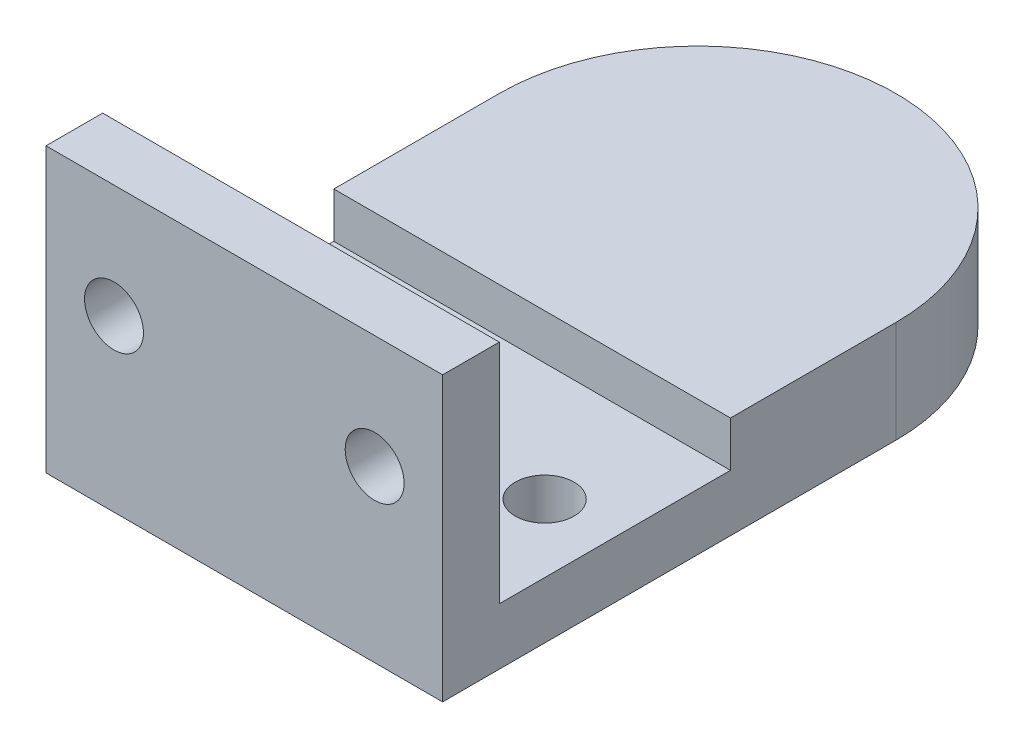
ISO-10303-21;
HEADER;
FILE_DESCRIPTION(('STEP AP214'),'2;1');
FILE_NAME('part.step','',(''),(''),'','','');
FILE_SCHEMA(('AUTOMOTIVE_DESIGN { 1 0 10303 214 1 1 1 1 }'));
ENDSEC;
DATA;
#1=APPLICATION_CONTEXT('core data for automotive mechanical design processes');
#2=APPLICATION_PROTOCOL_DEFINITION('international standard','automotive_design',2000,#1);
#3=PRODUCT_CONTEXT('',#1,'mechanical');
#4=PRODUCT('Part','Part','',(#3));
#5=PRODUCT_RELATED_PRODUCT_CATEGORY('part','',(#4));
#6=PRODUCT_DEFINITION_FORMATION('','',#4);
#7=PRODUCT_DEFINITION_CONTEXT('part definition',#1,'design');
#8=PRODUCT_DEFINITION('design','',#6,#7);
#9=PRODUCT_DEFINITION_SHAPE('','',#8);
#10=(LENGTH_UNIT() NAMED_UNIT(*) SI_UNIT(.MILLI.,.METRE.));
#11=(NAMED_UNIT(*) PLANE_ANGLE_UNIT() SI_UNIT($,.RADIAN.));
#12=(NAMED_UNIT(*) SI_UNIT($,.STERADIAN.) SOLID_ANGLE_UNIT());
#13=UNCERTAINTY_MEASURE_WITH_UNIT(LENGTH_MEASURE(1.E-05),#10,'distance_accuracy_value','');
#14=(GEOMETRIC_REPRESENTATION_CONTEXT(3) GLOBAL_UNCERTAINTY_ASSIGNED_CONTEXT((#13)) GLOBAL_UNIT_ASSIGNED_CONTEXT((#10,
#11,#12)) REPRESENTATION_CONTEXT('',''));
#15=CARTESIAN_POINT('',(0.,0.,0.));
#16=DIRECTION('',(0.,0.,1.));
#17=DIRECTION('',(1.,0.,0.));
#18=AXIS2_PLACEMENT_3D('',#15,#16,#17);
#19=CARTESIAN_POINT('',(0.,0.,0.));
#20=DIRECTION('',(0.,1.,0.));
#21=DIRECTION('',(0.,0.,1.));
#22=AXIS2_PLACEMENT_3D('',#19,#20,#21);
#23=PLANE('',#22);
#24=CARTESIAN_POINT('',(11.5,0.,25.));
#25=DIRECTION('',(0.,1.,0.));
#26=DIRECTION('',(0.,0.,1.));
#27=AXIS2_PLACEMENT_3D('',#24,#25,#26);
#28=CIRCLE('',#27,2.6);
#29=CARTESIAN_POINT('',(11.5,0.,27.6));
#30=VERTEX_POINT('',#29);
#31=EDGE_CURVE('E131',#30,#30,#28,.T.);
#32=ORIENTED_EDGE('',*,*,#31,.T.);
#33=EDGE_LOOP('',(#32));
#34=FACE_BOUND('',#33,.T.);
#35=CARTESIAN_POINT('',(-11.5,0.,25.));
#36=DIRECTION('',(0.,1.,0.));
#37=DIRECTION('',(0.,0.,1.));
#38=AXIS2_PLACEMENT_3D('',#35,#36,#37);
#39=CIRCLE('',#38,2.6);
#40=CARTESIAN_POINT('',(-11.5,0.,27.6));
#41=VERTEX_POINT('',#40);
#42=EDGE_CURVE('E135',#41,#41,#39,.T.);
#43=ORIENTED_EDGE('',*,*,#42,.T.);
#44=EDGE_LOOP('',(#43));
#45=FACE_BOUND('',#44,.T.);
#46=CARTESIAN_POINT('',(0.,0.,0.));
#47=DIRECTION('',(0.,1.,0.));
#48=DIRECTION('',(0.,0.,1.));
#49=AXIS2_PLACEMENT_3D('',#46,#47,#48);
#50=CIRCLE('',#49,17.5);
#51=CARTESIAN_POINT('',(17.5,0.,0.));
#52=VERTEX_POINT('',#51);
#53=CARTESIAN_POINT('',(-17.5,0.,0.));
#54=VERTEX_POINT('',#53);
#55=EDGE_CURVE('E148',#52,#54,#50,.T.);
#56=ORIENTED_EDGE('',*,*,#55,.F.);
#57=DIRECTION('',(0.,0.,-1.));
#58=VECTOR('',#57,1.);
#59=CARTESIAN_POINT('',(17.5,0.,0.));
#60=LINE('',#59,#58);
#61=CARTESIAN_POINT('',(17.5,0.,40.));
#62=VERTEX_POINT('',#61);
#63=EDGE_CURVE('E57',#62,#52,#60,.T.);
#64=ORIENTED_EDGE('',*,*,#63,.F.);
#65=DIRECTION('',(-1.,0.,0.));
#66=VECTOR('',#65,1.);
#67=CARTESIAN_POINT('',(-17.5,0.,40.));
#68=LINE('',#67,#66);
#69=CARTESIAN_POINT('',(-17.5,0.,40.));
#70=VERTEX_POINT('',#69);
#71=EDGE_CURVE('E160',#62,#70,#68,.T.);
#72=ORIENTED_EDGE('',*,*,#71,.T.);
#73=DIRECTION('',(0.,0.,1.));
#74=VECTOR('',#73,1.);
#75=CARTESIAN_POINT('',(-17.5,0.,0.));
#76=LINE('',#75,#74);
#77=EDGE_CURVE('E151',#54,#70,#76,.T.);
#78=ORIENTED_EDGE('',*,*,#77,.F.);
#79=EDGE_LOOP('',(#56,#64,#72,#78));
#80=FACE_BOUND('',#79,.T.);
#81=CARTESIAN_POINT('',(0.,0.,0.));
#82=DIRECTION('',(0.,1.,0.));
#83=DIRECTION('',(0.,0.,1.));
#84=AXIS2_PLACEMENT_3D('',#81,#82,#83);
#85=CIRCLE('',#84,11.1);
#86=CARTESIAN_POINT('',(0.,0.,11.1));
#87=VERTEX_POINT('',#86);
#88=EDGE_CURVE('E145',#87,#87,#85,.T.);
#89=ORIENTED_EDGE('',*,*,#88,.T.);
#90=EDGE_LOOP('',(#89));
#91=FACE_BOUND('',#90,.T.);
#92=ADVANCED_FACE('F32',(#34,#45,#80,#91),#23,.F.);
#93=CARTESIAN_POINT('',(0.,7.,0.));
#94=DIRECTION('',(0.,-1.,0.));
#95=DIRECTION('',(0.,0.,-1.));
#96=AXIS2_PLACEMENT_3D('',#93,#94,#95);
#97=CYLINDRICAL_SURFACE('',#96,17.5);
#98=ORIENTED_EDGE('',*,*,#55,.T.);
#99=DIRECTION('',(0.,-1.,0.));
#100=VECTOR('',#99,1.);
#101=CARTESIAN_POINT('',(-17.5,7.,0.));
#102=LINE('',#101,#100);
#103=CARTESIAN_POINT('',(-17.5,9.,0.));
#104=VERTEX_POINT('',#103);
#105=EDGE_CURVE('E11',#104,#54,#102,.T.);
#106=ORIENTED_EDGE('',*,*,#105,.F.);
#107=CARTESIAN_POINT('',(0.,9.,0.));
#108=DIRECTION('',(0.,1.,0.));
#109=DIRECTION('',(0.,0.,1.));
#110=AXIS2_PLACEMENT_3D('',#107,#108,#109);
#111=CIRCLE('',#110,17.5);
#112=CARTESIAN_POINT('',(17.5,9.,0.));
#113=VERTEX_POINT('',#112);
#114=EDGE_CURVE('E120',#113,#104,#111,.T.);
#115=ORIENTED_EDGE('',*,*,#114,.F.);
#116=DIRECTION('',(0.,-1.,0.));
#117=VECTOR('',#116,1.);
#118=CARTESIAN_POINT('',(17.5,7.,0.));
#119=LINE('',#118,#117);
#120=EDGE_CURVE('E41',#113,#52,#119,.T.);
#121=ORIENTED_EDGE('',*,*,#120,.T.);
#122=EDGE_LOOP('',(#98,#106,#115,#121));
#123=FACE_BOUND('',#122,.T.);
#124=ADVANCED_FACE('F34',(#123),#97,.T.);
#125=CARTESIAN_POINT('',(-17.5,7.,0.));
#126=DIRECTION('',(1.,0.,0.));
#127=DIRECTION('',(0.,0.,-1.));
#128=AXIS2_PLACEMENT_3D('',#125,#126,#127);
#129=PLANE('',#128);
#130=DIRECTION('',(0.,0.,1.));
#131=VECTOR('',#130,1.);
#132=CARTESIAN_POINT('',(-17.5,5.,15.));
#133=LINE('',#132,#131);
#134=CARTESIAN_POINT('',(-17.5,5.,14.6));
#135=VERTEX_POINT('',#134);
#136=CARTESIAN_POINT('',(-17.5,5.,35.));
#137=VERTEX_POINT('',#136);
#138=EDGE_CURVE('E114',#135,#137,#133,.T.);
#139=ORIENTED_EDGE('',*,*,#138,.F.);
#140=DIRECTION('',(0.,1.,0.));
#141=VECTOR('',#140,1.);
#142=CARTESIAN_POINT('',(-17.5,-30.002285639655,14.6));
#143=LINE('',#142,#141);
#144=CARTESIAN_POINT('',(-17.5,9.,14.6));
#145=VERTEX_POINT('',#144);
#146=EDGE_CURVE('E102',#135,#145,#143,.T.);
#147=ORIENTED_EDGE('',*,*,#146,.T.);
#148=DIRECTION('',(0.,0.,1.));
#149=VECTOR('',#148,1.);
#150=CARTESIAN_POINT('',(-17.5,9.,0.));
#151=LINE('',#150,#149);
#152=EDGE_CURVE('E110',#104,#145,#151,.T.);
#153=ORIENTED_EDGE('',*,*,#152,.F.);
#154=ORIENTED_EDGE('',*,*,#105,.T.);
#155=ORIENTED_EDGE('',*,*,#77,.T.);
#156=DIRECTION('',(0.,-1.,0.));
#157=VECTOR('',#156,1.);
#158=CARTESIAN_POINT('',(-17.5,25.,40.));
#159=LINE('',#158,#157);
#160=CARTESIAN_POINT('',(-17.5,25.,40.));
#161=VERTEX_POINT('',#160);
#162=EDGE_CURVE('E125',#161,#70,#159,.T.);
#163=ORIENTED_EDGE('',*,*,#162,.F.);
#164=DIRECTION('',(0.,0.,-1.));
#165=VECTOR('',#164,1.);
#166=CARTESIAN_POINT('',(-17.5,25.,35.));
#167=LINE('',#166,#165);
#168=CARTESIAN_POINT('',(-17.5,25.,35.));
#169=VERTEX_POINT('',#168);
#170=EDGE_CURVE('E165',#161,#169,#167,.T.);
#171=ORIENTED_EDGE('',*,*,#170,.T.);
#172=DIRECTION('',(0.,-1.,0.));
#173=VECTOR('',#172,1.);
#174=CARTESIAN_POINT('',(-17.5,25.,35.));
#175=LINE('',#174,#173);
#176=EDGE_CURVE('E186',#169,#137,#175,.T.);
#177=ORIENTED_EDGE('',*,*,#176,.T.);
#178=EDGE_LOOP('',(#139,#147,#153,#154,#155,#163,#171,#177));
#179=FACE_BOUND('',#178,.T.);
#180=ADVANCED_FACE('F109',(#179),#129,.F.);
#181=CARTESIAN_POINT('',(17.5,7.,0.));
#182=DIRECTION('',(-1.,0.,0.));
#183=DIRECTION('',(0.,0.,1.));
#184=AXIS2_PLACEMENT_3D('',#181,#182,#183);
#185=PLANE('',#184);
#186=DIRECTION('',(0.,0.,-1.));
#187=VECTOR('',#186,1.);
#188=CARTESIAN_POINT('',(17.5,9.,0.));
#189=LINE('',#188,#187);
#190=CARTESIAN_POINT('',(17.5,9.,14.6));
#191=VERTEX_POINT('',#190);
#192=EDGE_CURVE('E121',#191,#113,#189,.T.);
#193=ORIENTED_EDGE('',*,*,#192,.F.);
#194=DIRECTION('',(0.,1.,0.));
#195=VECTOR('',#194,1.);
#196=CARTESIAN_POINT('',(17.5,-30.002285639655,14.6));
#197=LINE('',#196,#195);
#198=CARTESIAN_POINT('',(17.5,5.,14.6));
#199=VERTEX_POINT('',#198);
#200=EDGE_CURVE('E49',#199,#191,#197,.T.);
#201=ORIENTED_EDGE('',*,*,#200,.F.);
#202=DIRECTION('',(0.,0.,-1.));
#203=VECTOR('',#202,1.);
#204=CARTESIAN_POINT('',(17.5,5.,15.));
#205=LINE('',#204,#203);
#206=CARTESIAN_POINT('',(17.5,5.,35.));
#207=VERTEX_POINT('',#206);
#208=EDGE_CURVE('E143',#207,#199,#205,.T.);
#209=ORIENTED_EDGE('',*,*,#208,.F.);
#210=DIRECTION('',(0.,-1.,0.));
#211=VECTOR('',#210,1.);
#212=CARTESIAN_POINT('',(17.5,25.,35.));
#213=LINE('',#212,#211);
#214=CARTESIAN_POINT('',(17.5,25.,35.));
#215=VERTEX_POINT('',#214);
#216=EDGE_CURVE('E192',#215,#207,#213,.T.);
#217=ORIENTED_EDGE('',*,*,#216,.F.);
#218=DIRECTION('',(0.,0.,1.));
#219=VECTOR('',#218,1.);
#220=CARTESIAN_POINT('',(17.5,25.,35.));
#221=LINE('',#220,#219);
#222=CARTESIAN_POINT('',(17.5,25.,40.));
#223=VERTEX_POINT('',#222);
#224=EDGE_CURVE('E181',#215,#223,#221,.T.);
#225=ORIENTED_EDGE('',*,*,#224,.T.);
#226=DIRECTION('',(0.,-1.,0.));
#227=VECTOR('',#226,1.);
#228=CARTESIAN_POINT('',(17.5,25.,40.));
#229=LINE('',#228,#227);
#230=EDGE_CURVE('E190',#223,#62,#229,.T.);
#231=ORIENTED_EDGE('',*,*,#230,.T.);
#232=ORIENTED_EDGE('',*,*,#63,.T.);
#233=ORIENTED_EDGE('',*,*,#120,.F.);
#234=EDGE_LOOP('',(#193,#201,#209,#217,#225,#231,#232,#233));
#235=FACE_BOUND('',#234,.T.);
#236=ADVANCED_FACE('F211',(#235),#185,.F.);
#237=CARTESIAN_POINT('',(0.,7.,0.));
#238=DIRECTION('',(0.,-1.,0.));
#239=DIRECTION('',(0.,0.,-1.));
#240=AXIS2_PLACEMENT_3D('',#237,#238,#239);
#241=CYLINDRICAL_SURFACE('',#240,11.1);
#242=CARTESIAN_POINT('',(0.,7.,0.));
#243=DIRECTION('',(0.,1.,0.));
#244=DIRECTION('',(0.,0.,1.));
#245=AXIS2_PLACEMENT_3D('',#242,#243,#244);
#246=CIRCLE('',#245,11.1);
#247=CARTESIAN_POINT('',(0.,7.,11.1));
#248=VERTEX_POINT('',#247);
#249=EDGE_CURVE('E123',#248,#248,#246,.T.);
#250=ORIENTED_EDGE('',*,*,#249,.T.);
#251=EDGE_LOOP('',(#250));
#252=FACE_BOUND('',#251,.T.);
#253=ORIENTED_EDGE('',*,*,#88,.F.);
#254=EDGE_LOOP('',(#253));
#255=FACE_BOUND('',#254,.T.);
#256=ADVANCED_FACE('F233',(#252,#255),#241,.F.);
#257=CARTESIAN_POINT('',(0.,5.,0.));
#258=DIRECTION('',(0.,1.,0.));
#259=DIRECTION('',(0.,0.,1.));
#260=AXIS2_PLACEMENT_3D('',#257,#258,#259);
#261=PLANE('',#260);
#262=CARTESIAN_POINT('',(11.5,5.,25.));
#263=DIRECTION('',(0.,1.,0.));
#264=DIRECTION('',(0.,0.,1.));
#265=AXIS2_PLACEMENT_3D('',#262,#263,#264);
#266=CIRCLE('',#265,2.6);
#267=CARTESIAN_POINT('',(11.5,5.,27.6));
#268=VERTEX_POINT('',#267);
#269=EDGE_CURVE('E134',#268,#268,#266,.T.);
#270=ORIENTED_EDGE('',*,*,#269,.F.);
#271=EDGE_LOOP('',(#270));
#272=FACE_BOUND('',#271,.T.);
#273=CARTESIAN_POINT('',(-11.5,5.,25.));
#274=DIRECTION('',(0.,1.,0.));
#275=DIRECTION('',(0.,0.,1.));
#276=AXIS2_PLACEMENT_3D('',#273,#274,#275);
#277=CIRCLE('',#276,2.6);
#278=CARTESIAN_POINT('',(-11.5,5.,27.6));
#279=VERTEX_POINT('',#278);
#280=EDGE_CURVE('E138',#279,#279,#277,.T.);
#281=ORIENTED_EDGE('',*,*,#280,.F.);
#282=EDGE_LOOP('',(#281));
#283=FACE_BOUND('',#282,.T.);
#284=ORIENTED_EDGE('',*,*,#138,.T.);
#285=DIRECTION('',(1.,0.,0.));
#286=VECTOR('',#285,1.);
#287=CARTESIAN_POINT('',(-17.5,5.,35.));
#288=LINE('',#287,#286);
#289=EDGE_CURVE('E140',#137,#207,#288,.T.);
#290=ORIENTED_EDGE('',*,*,#289,.T.);
#291=ORIENTED_EDGE('',*,*,#208,.T.);
#292=DIRECTION('',(1.,0.,0.));
#293=VECTOR('',#292,1.);
#294=CARTESIAN_POINT('',(-17.5,5.,14.6));
#295=LINE('',#294,#293);
#296=EDGE_CURVE('E116',#135,#199,#295,.T.);
#297=ORIENTED_EDGE('',*,*,#296,.F.);
#298=EDGE_LOOP('',(#284,#290,#291,#297));
#299=FACE_BOUND('',#298,.T.);
#300=ADVANCED_FACE('F197',(#272,#283,#299),#261,.T.);
#301=CARTESIAN_POINT('',(-11.5,0.,25.));
#302=DIRECTION('',(0.,1.,0.));
#303=DIRECTION('',(0.,0.,1.));
#304=AXIS2_PLACEMENT_3D('',#301,#302,#303);
#305=CYLINDRICAL_SURFACE('',#304,2.6);
#306=ORIENTED_EDGE('',*,*,#280,.T.);
#307=EDGE_LOOP('',(#306));
#308=FACE_BOUND('',#307,.T.);
#309=ORIENTED_EDGE('',*,*,#42,.F.);
#310=EDGE_LOOP('',(#309));
#311=FACE_BOUND('',#310,.T.);
#312=ADVANCED_FACE('F243',(#308,#311),#305,.F.);
#313=CARTESIAN_POINT('',(11.5,0.,25.));
#314=DIRECTION('',(0.,1.,0.));
#315=DIRECTION('',(0.,0.,1.));
#316=AXIS2_PLACEMENT_3D('',#313,#314,#315);
#317=CYLINDRICAL_SURFACE('',#316,2.6);
#318=ORIENTED_EDGE('',*,*,#269,.T.);
#319=EDGE_LOOP('',(#318));
#320=FACE_BOUND('',#319,.T.);
#321=ORIENTED_EDGE('',*,*,#31,.F.);
#322=EDGE_LOOP('',(#321));
#323=FACE_BOUND('',#322,.T.);
#324=ADVANCED_FACE('F251',(#320,#323),#317,.F.);
#325=CARTESIAN_POINT('',(0.,7.,0.));
#326=DIRECTION('',(0.,1.,0.));
#327=DIRECTION('',(0.,0.,1.));
#328=AXIS2_PLACEMENT_3D('',#325,#326,#327);
#329=PLANE('',#328);
#330=ORIENTED_EDGE('',*,*,#249,.F.);
#331=EDGE_LOOP('',(#330));
#332=FACE_BOUND('',#331,.T.);
#333=ADVANCED_FACE('F249',(#332),#329,.F.);
#334=CARTESIAN_POINT('',(0.,9.,0.));
#335=DIRECTION('',(0.,1.,0.));
#336=DIRECTION('',(0.,0.,1.));
#337=AXIS2_PLACEMENT_3D('',#334,#335,#336);
#338=PLANE('',#337);
#339=DIRECTION('',(-1.,0.,0.));
#340=VECTOR('',#339,1.);
#341=CARTESIAN_POINT('',(-17.5,9.,14.6));
#342=LINE('',#341,#340);
#343=EDGE_CURVE('E99',#191,#145,#342,.T.);
#344=ORIENTED_EDGE('',*,*,#343,.F.);
#345=ORIENTED_EDGE('',*,*,#192,.T.);
#346=ORIENTED_EDGE('',*,*,#114,.T.);
#347=ORIENTED_EDGE('',*,*,#152,.T.);
#348=EDGE_LOOP('',(#344,#345,#346,#347));
#349=FACE_BOUND('',#348,.T.);
#350=ADVANCED_FACE('F118',(#349),#338,.T.);
#351=CARTESIAN_POINT('',(-17.5,25.,35.));
#352=DIRECTION('',(0.,0.,-1.));
#353=DIRECTION('',(-1.,0.,0.));
#354=AXIS2_PLACEMENT_3D('',#351,#352,#353);
#355=PLANE('',#354);
#356=CARTESIAN_POINT('',(-11.5,15.,35.));
#357=DIRECTION('',(0.,0.,-1.));
#358=DIRECTION('',(-1.,0.,0.));
#359=AXIS2_PLACEMENT_3D('',#356,#357,#358);
#360=CIRCLE('',#359,2.6);
#361=CARTESIAN_POINT('',(-14.1,15.,35.));
#362=VERTEX_POINT('',#361);
#363=EDGE_CURVE('E172',#362,#362,#360,.T.);
#364=ORIENTED_EDGE('',*,*,#363,.F.);
#365=EDGE_LOOP('',(#364));
#366=FACE_BOUND('',#365,.T.);
#367=CARTESIAN_POINT('',(11.5,15.,35.));
#368=DIRECTION('',(0.,0.,-1.));
#369=DIRECTION('',(-1.,0.,0.));
#370=AXIS2_PLACEMENT_3D('',#367,#368,#369);
#371=CIRCLE('',#370,2.6);
#372=CARTESIAN_POINT('',(8.9,15.,35.));
#373=VERTEX_POINT('',#372);
#374=EDGE_CURVE('E161',#373,#373,#371,.T.);
#375=ORIENTED_EDGE('',*,*,#374,.F.);
#376=EDGE_LOOP('',(#375));
#377=FACE_BOUND('',#376,.T.);
#378=ORIENTED_EDGE('',*,*,#289,.F.);
#379=ORIENTED_EDGE('',*,*,#176,.F.);
#380=DIRECTION('',(1.,0.,0.));
#381=VECTOR('',#380,1.);
#382=CARTESIAN_POINT('',(-17.5,25.,35.));
#383=LINE('',#382,#381);
#384=EDGE_CURVE('E178',#169,#215,#383,.T.);
#385=ORIENTED_EDGE('',*,*,#384,.T.);
#386=ORIENTED_EDGE('',*,*,#216,.T.);
#387=EDGE_LOOP('',(#378,#379,#385,#386));
#388=FACE_BOUND('',#387,.T.);
#389=ADVANCED_FACE('F205',(#366,#377,#388),#355,.T.);
#390=CARTESIAN_POINT('',(-17.5,25.,40.));
#391=DIRECTION('',(0.,0.,1.));
#392=DIRECTION('',(1.,0.,0.));
#393=AXIS2_PLACEMENT_3D('',#390,#391,#392);
#394=PLANE('',#393);
#395=CARTESIAN_POINT('',(-11.5,15.,40.));
#396=DIRECTION('',(0.,0.,1.));
#397=DIRECTION('',(1.,0.,0.));
#398=AXIS2_PLACEMENT_3D('',#395,#396,#397);
#399=CIRCLE('',#398,2.6);
#400=CARTESIAN_POINT('',(-8.9,15.,40.));
#401=VERTEX_POINT('',#400);
#402=EDGE_CURVE('E36',#401,#401,#399,.T.);
#403=ORIENTED_EDGE('',*,*,#402,.F.);
#404=EDGE_LOOP('',(#403));
#405=FACE_BOUND('',#404,.T.);
#406=CARTESIAN_POINT('',(11.5,15.,40.));
#407=DIRECTION('',(0.,0.,1.));
#408=DIRECTION('',(1.,0.,0.));
#409=AXIS2_PLACEMENT_3D('',#406,#407,#408);
#410=CIRCLE('',#409,2.6);
#411=CARTESIAN_POINT('',(14.1,15.,40.));
#412=VERTEX_POINT('',#411);
#413=EDGE_CURVE('E158',#412,#412,#410,.T.);
#414=ORIENTED_EDGE('',*,*,#413,.F.);
#415=EDGE_LOOP('',(#414));
#416=FACE_BOUND('',#415,.T.);
#417=ORIENTED_EDGE('',*,*,#71,.F.);
#418=ORIENTED_EDGE('',*,*,#230,.F.);
#419=DIRECTION('',(-1.,0.,0.));
#420=VECTOR('',#419,1.);
#421=CARTESIAN_POINT('',(-17.5,25.,40.));
#422=LINE('',#421,#420);
#423=EDGE_CURVE('E184',#223,#161,#422,.T.);
#424=ORIENTED_EDGE('',*,*,#423,.T.);
#425=ORIENTED_EDGE('',*,*,#162,.T.);
#426=EDGE_LOOP('',(#417,#418,#424,#425));
#427=FACE_BOUND('',#426,.T.);
#428=ADVANCED_FACE('F208',(#405,#416,#427),#394,.T.);
#429=CARTESIAN_POINT('',(0.,25.,0.));
#430=DIRECTION('',(0.,1.,0.));
#431=DIRECTION('',(0.,0.,1.));
#432=AXIS2_PLACEMENT_3D('',#429,#430,#431);
#433=PLANE('',#432);
#434=ORIENTED_EDGE('',*,*,#170,.F.);
#435=ORIENTED_EDGE('',*,*,#423,.F.);
#436=ORIENTED_EDGE('',*,*,#224,.F.);
#437=ORIENTED_EDGE('',*,*,#384,.F.);
#438=EDGE_LOOP('',(#434,#435,#436,#437));
#439=FACE_BOUND('',#438,.T.);
#440=ADVANCED_FACE('F214',(#439),#433,.T.);
#441=CARTESIAN_POINT('',(11.5,15.,60.));
#442=DIRECTION('',(0.,0.,-1.));
#443=DIRECTION('',(-1.,0.,0.));
#444=AXIS2_PLACEMENT_3D('',#441,#442,#443);
#445=CYLINDRICAL_SURFACE('',#444,2.6);
#446=ORIENTED_EDGE('',*,*,#413,.T.);
#447=EDGE_LOOP('',(#446));
#448=FACE_BOUND('',#447,.T.);
#449=ORIENTED_EDGE('',*,*,#374,.T.);
#450=EDGE_LOOP('',(#449));
#451=FACE_BOUND('',#450,.T.);
#452=ADVANCED_FACE('F302',(#448,#451),#445,.F.);
#453=CARTESIAN_POINT('',(-11.5,15.,60.));
#454=DIRECTION('',(0.,0.,-1.));
#455=DIRECTION('',(-1.,0.,0.));
#456=AXIS2_PLACEMENT_3D('',#453,#454,#455);
#457=CYLINDRICAL_SURFACE('',#456,2.6);
#458=ORIENTED_EDGE('',*,*,#402,.T.);
#459=EDGE_LOOP('',(#458));
#460=FACE_BOUND('',#459,.T.);
#461=ORIENTED_EDGE('',*,*,#363,.T.);
#462=EDGE_LOOP('',(#461));
#463=FACE_BOUND('',#462,.T.);
#464=ADVANCED_FACE('F203',(#460,#463),#457,.F.);
#465=CARTESIAN_POINT('',(-17.5,-30.002285639655,14.6));
#466=DIRECTION('',(0.,0.,-1.));
#467=DIRECTION('',(-1.,0.,0.));
#468=AXIS2_PLACEMENT_3D('',#465,#466,#467);
#469=PLANE('',#468);
#470=ORIENTED_EDGE('',*,*,#296,.T.);
#471=ORIENTED_EDGE('',*,*,#200,.T.);
#472=ORIENTED_EDGE('',*,*,#343,.T.);
#473=ORIENTED_EDGE('',*,*,#146,.F.);
#474=EDGE_LOOP('',(#470,#471,#472,#473));
#475=FACE_BOUND('',#474,.T.);
#476=ADVANCED_FACE('F101',(#475),#469,.F.);
#477=CLOSED_SHELL('',(#92,#124,#180,#236,#256,#300,#312,#324,#333,#350,#389,#428,#440,#452,#464,#476));
#478=MANIFOLD_SOLID_BREP('B2',#477);
#479=ADVANCED_BREP_SHAPE_REPRESENTATION('',(#18,#478),#14);
#480=SHAPE_DEFINITION_REPRESENTATION(#9,#479);
ENDSEC;
END-ISO-10303-21;
